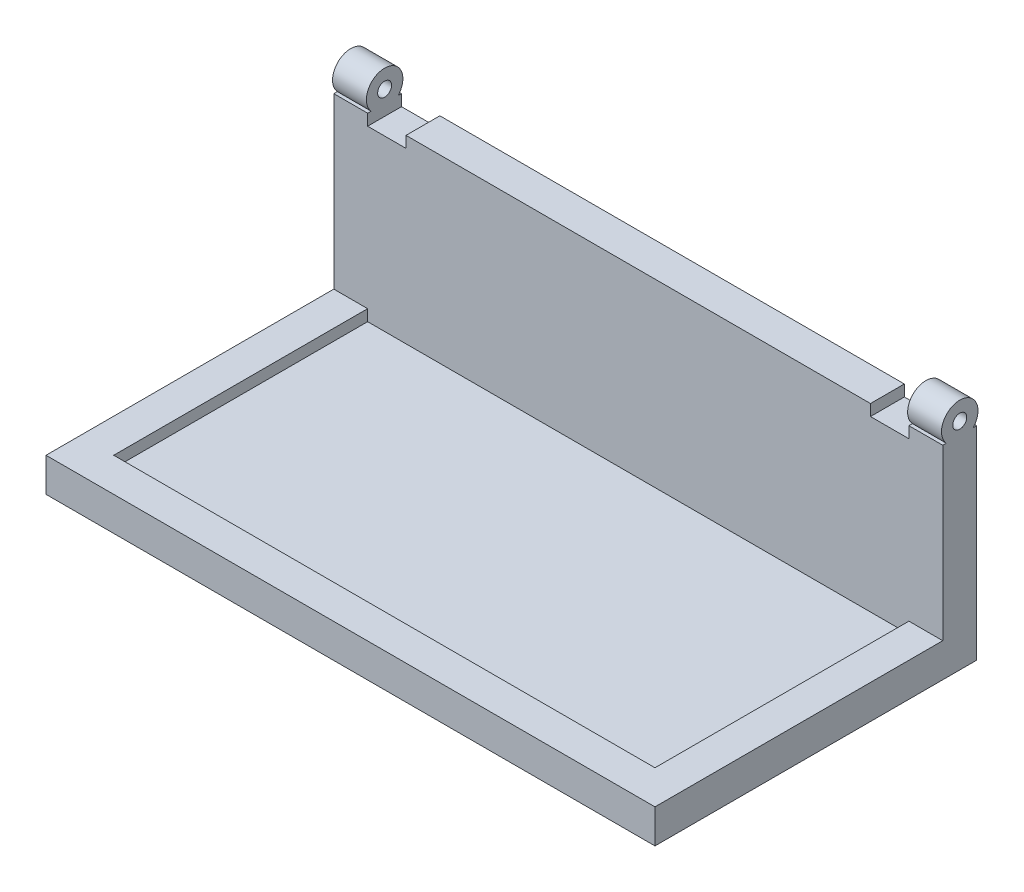
ISO-10303-21;
HEADER;
FILE_DESCRIPTION(('STEP AP214'),'2;1');
FILE_NAME('part.step','',(''),(''),'','','');
FILE_SCHEMA(('AUTOMOTIVE_DESIGN { 1 0 10303 214 1 1 1 1 }'));
ENDSEC;
DATA;
#1=APPLICATION_CONTEXT('core data for automotive mechanical design processes');
#2=APPLICATION_PROTOCOL_DEFINITION('international standard','automotive_design',2000,#1);
#3=PRODUCT_CONTEXT('',#1,'mechanical');
#4=PRODUCT('Part','Part','',(#3));
#5=PRODUCT_RELATED_PRODUCT_CATEGORY('part','',(#4));
#6=PRODUCT_DEFINITION_FORMATION('','',#4);
#7=PRODUCT_DEFINITION_CONTEXT('part definition',#1,'design');
#8=PRODUCT_DEFINITION('design','',#6,#7);
#9=PRODUCT_DEFINITION_SHAPE('','',#8);
#10=(LENGTH_UNIT() NAMED_UNIT(*) SI_UNIT(.MILLI.,.METRE.));
#11=(NAMED_UNIT(*) PLANE_ANGLE_UNIT() SI_UNIT($,.RADIAN.));
#12=(NAMED_UNIT(*) SI_UNIT($,.STERADIAN.) SOLID_ANGLE_UNIT());
#13=UNCERTAINTY_MEASURE_WITH_UNIT(LENGTH_MEASURE(1.E-05),#10,'distance_accuracy_value','');
#14=(GEOMETRIC_REPRESENTATION_CONTEXT(3) GLOBAL_UNCERTAINTY_ASSIGNED_CONTEXT((#13)) GLOBAL_UNIT_ASSIGNED_CONTEXT((#10,
#11,#12)) REPRESENTATION_CONTEXT('',''));
#15=CARTESIAN_POINT('',(0.,0.,0.));
#16=DIRECTION('',(0.,0.,1.));
#17=DIRECTION('',(1.,0.,0.));
#18=AXIS2_PLACEMENT_3D('',#15,#16,#17);
#19=CARTESIAN_POINT('',(0.,90.,0.));
#20=DIRECTION('',(0.,1.,0.));
#21=DIRECTION('',(0.,0.,1.));
#22=AXIS2_PLACEMENT_3D('',#19,#20,#21);
#23=PLANE('',#22);
#24=DIRECTION('',(0.,0.,1.));
#25=VECTOR('',#24,1.);
#26=CARTESIAN_POINT('',(-143.208401976936,90.,0.));
#27=LINE('',#26,#25);
#28=CARTESIAN_POINT('',(-143.208401976936,90.,-83.5425041186162));
#29=VERTEX_POINT('',#28);
#30=CARTESIAN_POINT('',(-143.208401976936,90.,-82.0449720805085));
#31=VERTEX_POINT('',#30);
#32=EDGE_CURVE('E201',#29,#31,#27,.T.);
#33=ORIENTED_EDGE('',*,*,#32,.F.);
#34=DIRECTION('',(-1.,0.,0.));
#35=VECTOR('',#34,1.);
#36=CARTESIAN_POINT('',(111.591598023064,90.,-83.5425041186161));
#37=LINE('',#36,#35);
#38=CARTESIAN_POINT('',(-158.208401976936,90.,-83.5425041186162));
#39=VERTEX_POINT('',#38);
#40=EDGE_CURVE('E272',#29,#39,#37,.T.);
#41=ORIENTED_EDGE('',*,*,#40,.T.);
#42=DIRECTION('',(0.,0.,1.));
#43=VECTOR('',#42,1.);
#44=CARTESIAN_POINT('',(-158.208401976936,90.,-83.5425041186162));
#45=LINE('',#44,#43);
#46=CARTESIAN_POINT('',(-158.208401976936,90.,-82.0449720805085));
#47=VERTEX_POINT('',#46);
#48=EDGE_CURVE('E278',#39,#47,#45,.T.);
#49=ORIENTED_EDGE('',*,*,#48,.T.);
#50=DIRECTION('',(1.,0.,0.));
#51=VECTOR('',#50,1.);
#52=CARTESIAN_POINT('',(-158.208401976936,90.,-82.0449720805085));
#53=LINE('',#52,#51);
#54=EDGE_CURVE('E347',#31,#47,#53,.F.);
#55=ORIENTED_EDGE('',*,*,#54,.F.);
#56=EDGE_LOOP('',(#33,#41,#49,#55));
#57=FACE_BOUND('',#56,.T.);
#58=ADVANCED_FACE('F34',(#57),#23,.T.);
#59=CARTESIAN_POINT('',(-143.208401976936,90.,-70.0970029147323));
#60=VERTEX_POINT('',#59);
#61=CARTESIAN_POINT('',(-143.208401976936,90.,-68.5425041186162));
#62=VERTEX_POINT('',#61);
#63=EDGE_CURVE('E384',#60,#62,#27,.T.);
#64=ORIENTED_EDGE('',*,*,#63,.F.);
#65=DIRECTION('',(1.,0.,0.));
#66=VECTOR('',#65,1.);
#67=CARTESIAN_POINT('',(-158.208401976936,90.,-70.0970029147323));
#68=LINE('',#67,#66);
#69=CARTESIAN_POINT('',(-158.208401976936,90.,-70.0970029147323));
#70=VERTEX_POINT('',#69);
#71=EDGE_CURVE('E350',#70,#60,#68,.T.);
#72=ORIENTED_EDGE('',*,*,#71,.F.);
#73=CARTESIAN_POINT('',(-158.208401976936,90.,-68.5425041186162));
#74=VERTEX_POINT('',#73);
#75=EDGE_CURVE('E276',#70,#74,#45,.T.);
#76=ORIENTED_EDGE('',*,*,#75,.T.);
#77=DIRECTION('',(1.,0.,0.));
#78=VECTOR('',#77,1.);
#79=CARTESIAN_POINT('',(-143.208401976936,90.,-68.5425041186162));
#80=LINE('',#79,#78);
#81=EDGE_CURVE('E266',#74,#62,#80,.T.);
#82=ORIENTED_EDGE('',*,*,#81,.T.);
#83=EDGE_LOOP('',(#64,#72,#76,#82));
#84=FACE_BOUND('',#83,.T.);
#85=ADVANCED_FACE('F409',(#84),#23,.T.);
#86=DIRECTION('',(0.,0.,-1.));
#87=VECTOR('',#86,1.);
#88=CARTESIAN_POINT('',(-126.208401976936,90.,0.));
#89=LINE('',#88,#87);
#90=CARTESIAN_POINT('',(-126.208401976936,90.,-68.5425041186162));
#91=VERTEX_POINT('',#90);
#92=CARTESIAN_POINT('',(-126.208401976936,90.,-83.5425041186161));
#93=VERTEX_POINT('',#92);
#94=EDGE_CURVE('E230',#91,#93,#89,.T.);
#95=ORIENTED_EDGE('',*,*,#94,.F.);
#96=CARTESIAN_POINT('',(79.5688678934987,90.,-68.5425041186162));
#97=VERTEX_POINT('',#96);
#98=EDGE_CURVE('E207',#91,#97,#80,.T.);
#99=ORIENTED_EDGE('',*,*,#98,.T.);
#100=DIRECTION('',(0.,0.,1.));
#101=VECTOR('',#100,1.);
#102=CARTESIAN_POINT('',(79.5688678934987,90.,-83.5425041186161));
#103=LINE('',#102,#101);
#104=CARTESIAN_POINT('',(79.5688678934987,90.,-83.5425041186161));
#105=VERTEX_POINT('',#104);
#106=EDGE_CURVE('E224',#105,#97,#103,.T.);
#107=ORIENTED_EDGE('',*,*,#106,.F.);
#108=EDGE_CURVE('E277',#105,#93,#37,.T.);
#109=ORIENTED_EDGE('',*,*,#108,.T.);
#110=EDGE_LOOP('',(#95,#99,#107,#109));
#111=FACE_BOUND('',#110,.T.);
#112=ADVANCED_FACE('F381',(#111),#23,.T.);
#113=DIRECTION('',(0.,0.,-1.));
#114=VECTOR('',#113,1.);
#115=CARTESIAN_POINT('',(96.5915980230643,90.,-68.5425041186161));
#116=LINE('',#115,#114);
#117=CARTESIAN_POINT('',(96.5915980230643,90.,-68.5425041186161));
#118=VERTEX_POINT('',#117);
#119=CARTESIAN_POINT('',(96.5915980230643,90.,-70.0970029147323));
#120=VERTEX_POINT('',#119);
#121=EDGE_CURVE('E228',#118,#120,#116,.T.);
#122=ORIENTED_EDGE('',*,*,#121,.F.);
#123=CARTESIAN_POINT('',(111.591598023064,90.,-68.5425041186162));
#124=VERTEX_POINT('',#123);
#125=EDGE_CURVE('E270',#118,#124,#80,.T.);
#126=ORIENTED_EDGE('',*,*,#125,.T.);
#127=DIRECTION('',(0.,0.,-1.));
#128=VECTOR('',#127,1.);
#129=CARTESIAN_POINT('',(111.591598023064,90.,-68.5425041186162));
#130=LINE('',#129,#128);
#131=CARTESIAN_POINT('',(111.591598023064,90.,-70.0970029147323));
#132=VERTEX_POINT('',#131);
#133=EDGE_CURVE('E55',#124,#132,#130,.T.);
#134=ORIENTED_EDGE('',*,*,#133,.T.);
#135=DIRECTION('',(-1.,0.,0.));
#136=VECTOR('',#135,1.);
#137=CARTESIAN_POINT('',(111.591598023064,90.,-70.0970029147323));
#138=LINE('',#137,#136);
#139=EDGE_CURVE('E42',#120,#132,#138,.F.);
#140=ORIENTED_EDGE('',*,*,#139,.F.);
#141=EDGE_LOOP('',(#122,#126,#134,#140));
#142=FACE_BOUND('',#141,.T.);
#143=ADVANCED_FACE('F378',(#142),#23,.T.);
#144=CARTESIAN_POINT('',(-158.208401976936,15.,58.9574958813839));
#145=DIRECTION('',(0.,0.,-1.));
#146=DIRECTION('',(-1.,0.,0.));
#147=AXIS2_PLACEMENT_3D('',#144,#145,#146);
#148=PLANE('',#147);
#149=DIRECTION('',(1.,0.,0.));
#150=VECTOR('',#149,1.);
#151=CARTESIAN_POINT('',(-158.208401976936,0.,58.9574958813839));
#152=LINE('',#151,#150);
#153=CARTESIAN_POINT('',(-158.208401976936,0.,58.9574958813839));
#154=VERTEX_POINT('',#153);
#155=CARTESIAN_POINT('',(111.591598023064,0.,58.9574958813839));
#156=VERTEX_POINT('',#155);
#157=EDGE_CURVE('E312',#154,#156,#152,.T.);
#158=ORIENTED_EDGE('',*,*,#157,.T.);
#159=DIRECTION('',(0.,-1.,0.));
#160=VECTOR('',#159,1.);
#161=CARTESIAN_POINT('',(111.591598023064,15.,58.9574958813839));
#162=LINE('',#161,#160);
#163=CARTESIAN_POINT('',(111.591598023064,15.,58.9574958813839));
#164=VERTEX_POINT('',#163);
#165=EDGE_CURVE('E344',#164,#156,#162,.T.);
#166=ORIENTED_EDGE('',*,*,#165,.F.);
#167=DIRECTION('',(1.,0.,0.));
#168=VECTOR('',#167,1.);
#169=CARTESIAN_POINT('',(-158.208401976936,15.,58.9574958813839));
#170=LINE('',#169,#168);
#171=CARTESIAN_POINT('',(-158.208401976936,15.,58.9574958813839));
#172=VERTEX_POINT('',#171);
#173=EDGE_CURVE('E320',#172,#164,#170,.T.);
#174=ORIENTED_EDGE('',*,*,#173,.F.);
#175=DIRECTION('',(0.,-1.,0.));
#176=VECTOR('',#175,1.);
#177=CARTESIAN_POINT('',(-158.208401976936,15.,58.9574958813839));
#178=LINE('',#177,#176);
#179=EDGE_CURVE('E328',#172,#154,#178,.T.);
#180=ORIENTED_EDGE('',*,*,#179,.T.);
#181=EDGE_LOOP('',(#158,#166,#174,#180));
#182=FACE_BOUND('',#181,.T.);
#183=ADVANCED_FACE('F36',(#182),#148,.F.);
#184=CARTESIAN_POINT('',(111.591598023064,15.,58.9574958813839));
#185=DIRECTION('',(-1.,0.,0.));
#186=DIRECTION('',(0.,0.,1.));
#187=AXIS2_PLACEMENT_3D('',#184,#185,#186);
#188=PLANE('',#187);
#189=CARTESIAN_POINT('',(111.591598023064,90.,-82.0449720805085));
#190=VERTEX_POINT('',#189);
#191=CARTESIAN_POINT('',(111.591598023064,90.,-83.5425041186161));
#192=VERTEX_POINT('',#191);
#193=EDGE_CURVE('E269',#190,#192,#130,.T.);
#194=ORIENTED_EDGE('',*,*,#193,.F.);
#195=CARTESIAN_POINT('',(111.591598023064,95.4538367899318,-76.0709874976204));
#196=DIRECTION('',(-1.,0.,0.));
#197=DIRECTION('',(0.,0.,1.));
#198=AXIS2_PLACEMENT_3D('',#195,#196,#197);
#199=CIRCLE('',#198,8.08905603440837);
#200=EDGE_CURVE('E248',#132,#190,#199,.T.);
#201=ORIENTED_EDGE('',*,*,#200,.F.);
#202=ORIENTED_EDGE('',*,*,#133,.F.);
#203=DIRECTION('',(0.,-1.,0.));
#204=VECTOR('',#203,1.);
#205=CARTESIAN_POINT('',(111.591598023064,90.,-68.5425041186162));
#206=LINE('',#205,#204);
#207=CARTESIAN_POINT('',(111.591598023064,15.,-68.5425041186162));
#208=VERTEX_POINT('',#207);
#209=EDGE_CURVE('E286',#124,#208,#206,.T.);
#210=ORIENTED_EDGE('',*,*,#209,.T.);
#211=DIRECTION('',(0.,0.,-1.));
#212=VECTOR('',#211,1.);
#213=CARTESIAN_POINT('',(111.591598023064,15.,58.9574958813839));
#214=LINE('',#213,#212);
#215=EDGE_CURVE('E323',#164,#208,#214,.T.);
#216=ORIENTED_EDGE('',*,*,#215,.F.);
#217=ORIENTED_EDGE('',*,*,#165,.T.);
#218=DIRECTION('',(0.,0.,-1.));
#219=VECTOR('',#218,1.);
#220=CARTESIAN_POINT('',(111.591598023064,0.,58.9574958813839));
#221=LINE('',#220,#219);
#222=CARTESIAN_POINT('',(111.591598023064,0.,-83.5425041186161));
#223=VERTEX_POINT('',#222);
#224=EDGE_CURVE('E331',#156,#223,#221,.T.);
#225=ORIENTED_EDGE('',*,*,#224,.T.);
#226=DIRECTION('',(0.,-1.,0.));
#227=VECTOR('',#226,1.);
#228=CARTESIAN_POINT('',(111.591598023064,15.,-83.5425041186161));
#229=LINE('',#228,#227);
#230=EDGE_CURVE('E341',#192,#223,#229,.T.);
#231=ORIENTED_EDGE('',*,*,#230,.F.);
#232=EDGE_LOOP('',(#194,#201,#202,#210,#216,#217,#225,#231));
#233=FACE_BOUND('',#232,.T.);
#234=CARTESIAN_POINT('',(111.591598023064,95.4538367899318,-76.0709874976204));
#235=DIRECTION('',(-1.,0.,0.));
#236=DIRECTION('',(0.,0.,1.));
#237=AXIS2_PLACEMENT_3D('',#234,#235,#236);
#238=CIRCLE('',#237,3.08905603440837);
#239=CARTESIAN_POINT('',(111.591598023064,95.4538367899318,-72.981931463212));
#240=VERTEX_POINT('',#239);
#241=EDGE_CURVE('E240',#240,#240,#238,.T.);
#242=ORIENTED_EDGE('',*,*,#241,.T.);
#243=EDGE_LOOP('',(#242));
#244=FACE_BOUND('',#243,.T.);
#245=ADVANCED_FACE('F358',(#233,#244),#188,.F.);
#246=CARTESIAN_POINT('',(-158.208401976936,15.,-83.5425041186162));
#247=DIRECTION('',(0.,0.,1.));
#248=DIRECTION('',(1.,0.,0.));
#249=AXIS2_PLACEMENT_3D('',#246,#247,#248);
#250=PLANE('',#249);
#251=ORIENTED_EDGE('',*,*,#40,.F.);
#252=DIRECTION('',(0.,1.,0.));
#253=VECTOR('',#252,1.);
#254=CARTESIAN_POINT('',(-143.208401976936,85.,-83.5425041186162));
#255=LINE('',#254,#253);
#256=CARTESIAN_POINT('',(-143.208401976936,85.,-83.5425041186162));
#257=VERTEX_POINT('',#256);
#258=EDGE_CURVE('E209',#257,#29,#255,.T.);
#259=ORIENTED_EDGE('',*,*,#258,.F.);
#260=DIRECTION('',(-1.,0.,0.));
#261=VECTOR('',#260,1.);
#262=CARTESIAN_POINT('',(0.,85.,-83.5425041186161));
#263=LINE('',#262,#261);
#264=CARTESIAN_POINT('',(-126.208401976936,85.,-83.5425041186161));
#265=VERTEX_POINT('',#264);
#266=EDGE_CURVE('E191',#265,#257,#263,.T.);
#267=ORIENTED_EDGE('',*,*,#266,.F.);
#268=DIRECTION('',(0.,1.,0.));
#269=VECTOR('',#268,1.);
#270=CARTESIAN_POINT('',(-126.208401976936,85.,-83.5425041186161));
#271=LINE('',#270,#269);
#272=EDGE_CURVE('E188',#265,#93,#271,.T.);
#273=ORIENTED_EDGE('',*,*,#272,.T.);
#274=ORIENTED_EDGE('',*,*,#108,.F.);
#275=DIRECTION('',(0.,1.,0.));
#276=VECTOR('',#275,1.);
#277=CARTESIAN_POINT('',(79.5688678934987,85.,-83.5425041186161));
#278=LINE('',#277,#276);
#279=CARTESIAN_POINT('',(79.5688678934987,85.,-83.5425041186161));
#280=VERTEX_POINT('',#279);
#281=EDGE_CURVE('E220',#280,#105,#278,.T.);
#282=ORIENTED_EDGE('',*,*,#281,.F.);
#283=DIRECTION('',(-1.,0.,0.));
#284=VECTOR('',#283,1.);
#285=CARTESIAN_POINT('',(96.5915980230643,85.,-83.5425041186161));
#286=LINE('',#285,#284);
#287=CARTESIAN_POINT('',(96.5915980230643,85.,-83.5425041186161));
#288=VERTEX_POINT('',#287);
#289=EDGE_CURVE('E233',#288,#280,#286,.T.);
#290=ORIENTED_EDGE('',*,*,#289,.F.);
#291=DIRECTION('',(0.,1.,0.));
#292=VECTOR('',#291,1.);
#293=CARTESIAN_POINT('',(96.5915980230643,85.,-83.5425041186161));
#294=LINE('',#293,#292);
#295=CARTESIAN_POINT('',(96.5915980230643,90.,-83.5425041186161));
#296=VERTEX_POINT('',#295);
#297=EDGE_CURVE('E217',#288,#296,#294,.T.);
#298=ORIENTED_EDGE('',*,*,#297,.T.);
#299=EDGE_CURVE('E273',#192,#296,#37,.T.);
#300=ORIENTED_EDGE('',*,*,#299,.F.);
#301=ORIENTED_EDGE('',*,*,#230,.T.);
#302=DIRECTION('',(-1.,0.,0.));
#303=VECTOR('',#302,1.);
#304=CARTESIAN_POINT('',(-158.208401976936,0.,-83.5425041186162));
#305=LINE('',#304,#303);
#306=CARTESIAN_POINT('',(-158.208401976936,0.,-83.5425041186162));
#307=VERTEX_POINT('',#306);
#308=EDGE_CURVE('E333',#223,#307,#305,.T.);
#309=ORIENTED_EDGE('',*,*,#308,.T.);
#310=DIRECTION('',(0.,-1.,0.));
#311=VECTOR('',#310,1.);
#312=CARTESIAN_POINT('',(-158.208401976936,15.,-83.5425041186162));
#313=LINE('',#312,#311);
#314=EDGE_CURVE('E338',#39,#307,#313,.T.);
#315=ORIENTED_EDGE('',*,*,#314,.F.);
#316=EDGE_LOOP('',(#251,#259,#267,#273,#274,#282,#290,#298,#300,#301,#309,#315));
#317=FACE_BOUND('',#316,.T.);
#318=ADVANCED_FACE('F366',(#317),#250,.F.);
#319=CARTESIAN_POINT('',(-158.208401976936,15.,58.9574958813839));
#320=DIRECTION('',(1.,0.,0.));
#321=DIRECTION('',(0.,0.,-1.));
#322=AXIS2_PLACEMENT_3D('',#319,#320,#321);
#323=PLANE('',#322);
#324=ORIENTED_EDGE('',*,*,#75,.F.);
#325=CARTESIAN_POINT('',(-158.208401976936,95.4538367899318,-76.0709874976204));
#326=DIRECTION('',(1.,0.,0.));
#327=DIRECTION('',(0.,0.,-1.));
#328=AXIS2_PLACEMENT_3D('',#325,#326,#327);
#329=CIRCLE('',#328,8.08905603440837);
#330=EDGE_CURVE('E260',#47,#70,#329,.T.);
#331=ORIENTED_EDGE('',*,*,#330,.F.);
#332=ORIENTED_EDGE('',*,*,#48,.F.);
#333=ORIENTED_EDGE('',*,*,#314,.T.);
#334=DIRECTION('',(0.,0.,1.));
#335=VECTOR('',#334,1.);
#336=CARTESIAN_POINT('',(-158.208401976936,0.,58.9574958813839));
#337=LINE('',#336,#335);
#338=EDGE_CURVE('E324',#307,#154,#337,.T.);
#339=ORIENTED_EDGE('',*,*,#338,.T.);
#340=ORIENTED_EDGE('',*,*,#179,.F.);
#341=DIRECTION('',(0.,0.,1.));
#342=VECTOR('',#341,1.);
#343=CARTESIAN_POINT('',(-158.208401976936,15.,58.9574958813839));
#344=LINE('',#343,#342);
#345=CARTESIAN_POINT('',(-158.208401976936,15.,-68.5425041186162));
#346=VERTEX_POINT('',#345);
#347=EDGE_CURVE('E326',#346,#172,#344,.T.);
#348=ORIENTED_EDGE('',*,*,#347,.F.);
#349=DIRECTION('',(0.,-1.,0.));
#350=VECTOR('',#349,1.);
#351=CARTESIAN_POINT('',(-158.208401976936,90.,-68.5425041186162));
#352=LINE('',#351,#350);
#353=EDGE_CURVE('E280',#74,#346,#352,.T.);
#354=ORIENTED_EDGE('',*,*,#353,.F.);
#355=EDGE_LOOP('',(#324,#331,#332,#333,#339,#340,#348,#354));
#356=FACE_BOUND('',#355,.T.);
#357=CARTESIAN_POINT('',(-158.208401976936,95.4538367899318,-76.0709874976204));
#358=DIRECTION('',(1.,0.,0.));
#359=DIRECTION('',(0.,0.,-1.));
#360=AXIS2_PLACEMENT_3D('',#357,#358,#359);
#361=CIRCLE('',#360,3.08905603440837);
#362=CARTESIAN_POINT('',(-158.208401976936,95.4538367899318,-79.1600435320288));
#363=VERTEX_POINT('',#362);
#364=EDGE_CURVE('E254',#363,#363,#361,.T.);
#365=ORIENTED_EDGE('',*,*,#364,.T.);
#366=EDGE_LOOP('',(#365));
#367=FACE_BOUND('',#366,.T.);
#368=ADVANCED_FACE('F402',(#356,#367),#323,.F.);
#369=CARTESIAN_POINT('',(0.,15.,0.));
#370=DIRECTION('',(0.,1.,0.));
#371=DIRECTION('',(0.,0.,1.));
#372=AXIS2_PLACEMENT_3D('',#369,#370,#371);
#373=PLANE('',#372);
#374=DIRECTION('',(1.,0.,0.));
#375=VECTOR('',#374,1.);
#376=CARTESIAN_POINT('',(-143.208401976936,15.,-68.5425041186162));
#377=LINE('',#376,#375);
#378=CARTESIAN_POINT('',(-143.208401976936,15.,-68.5425041186162));
#379=VERTEX_POINT('',#378);
#380=EDGE_CURVE('E263',#346,#379,#377,.T.);
#381=ORIENTED_EDGE('',*,*,#380,.F.);
#382=ORIENTED_EDGE('',*,*,#347,.T.);
#383=ORIENTED_EDGE('',*,*,#173,.T.);
#384=ORIENTED_EDGE('',*,*,#215,.T.);
#385=CARTESIAN_POINT('',(96.5915980230643,15.,-68.5425041186161));
#386=VERTEX_POINT('',#385);
#387=EDGE_CURVE('E283',#386,#208,#377,.T.);
#388=ORIENTED_EDGE('',*,*,#387,.F.);
#389=DIRECTION('',(0.,0.,-1.));
#390=VECTOR('',#389,1.);
#391=CARTESIAN_POINT('',(96.5915980230643,15.,43.9574958813839));
#392=LINE('',#391,#390);
#393=CARTESIAN_POINT('',(96.5915980230643,15.,43.9574958813839));
#394=VERTEX_POINT('',#393);
#395=EDGE_CURVE('E294',#394,#386,#392,.T.);
#396=ORIENTED_EDGE('',*,*,#395,.F.);
#397=DIRECTION('',(1.,0.,0.));
#398=VECTOR('',#397,1.);
#399=CARTESIAN_POINT('',(-143.208401976936,15.,43.9574958813839));
#400=LINE('',#399,#398);
#401=CARTESIAN_POINT('',(-143.208401976936,15.,43.9574958813839));
#402=VERTEX_POINT('',#401);
#403=EDGE_CURVE('E305',#402,#394,#400,.T.);
#404=ORIENTED_EDGE('',*,*,#403,.F.);
#405=DIRECTION('',(0.,0.,1.));
#406=VECTOR('',#405,1.);
#407=CARTESIAN_POINT('',(-143.208401976936,15.,-68.5425041186162));
#408=LINE('',#407,#406);
#409=EDGE_CURVE('E289',#379,#402,#408,.T.);
#410=ORIENTED_EDGE('',*,*,#409,.F.);
#411=EDGE_LOOP('',(#381,#382,#383,#384,#388,#396,#404,#410));
#412=FACE_BOUND('',#411,.T.);
#413=ADVANCED_FACE('F416',(#412),#373,.T.);
#414=CARTESIAN_POINT('',(0.,0.,0.));
#415=DIRECTION('',(0.,1.,0.));
#416=DIRECTION('',(0.,0.,1.));
#417=AXIS2_PLACEMENT_3D('',#414,#415,#416);
#418=PLANE('',#417);
#419=ORIENTED_EDGE('',*,*,#157,.F.);
#420=ORIENTED_EDGE('',*,*,#338,.F.);
#421=ORIENTED_EDGE('',*,*,#308,.F.);
#422=ORIENTED_EDGE('',*,*,#224,.F.);
#423=EDGE_LOOP('',(#419,#420,#421,#422));
#424=FACE_BOUND('',#423,.T.);
#425=ADVANCED_FACE('F435',(#424),#418,.F.);
#426=CARTESIAN_POINT('',(-143.208401976936,10.,-68.5425041186162));
#427=DIRECTION('',(-1.,0.,0.));
#428=DIRECTION('',(0.,0.,1.));
#429=AXIS2_PLACEMENT_3D('',#426,#427,#428);
#430=PLANE('',#429);
#431=ORIENTED_EDGE('',*,*,#409,.T.);
#432=DIRECTION('',(0.,1.,0.));
#433=VECTOR('',#432,1.);
#434=CARTESIAN_POINT('',(-143.208401976936,10.,43.9574958813839));
#435=LINE('',#434,#433);
#436=CARTESIAN_POINT('',(-143.208401976936,10.,43.9574958813839));
#437=VERTEX_POINT('',#436);
#438=EDGE_CURVE('E303',#437,#402,#435,.T.);
#439=ORIENTED_EDGE('',*,*,#438,.F.);
#440=DIRECTION('',(0.,0.,1.));
#441=VECTOR('',#440,1.);
#442=CARTESIAN_POINT('',(-143.208401976936,10.,-68.5425041186162));
#443=LINE('',#442,#441);
#444=CARTESIAN_POINT('',(-143.208401976936,10.,-68.5425041186162));
#445=VERTEX_POINT('',#444);
#446=EDGE_CURVE('E290',#445,#437,#443,.T.);
#447=ORIENTED_EDGE('',*,*,#446,.F.);
#448=DIRECTION('',(0.,1.,0.));
#449=VECTOR('',#448,1.);
#450=CARTESIAN_POINT('',(-143.208401976936,10.,-68.5425041186162));
#451=LINE('',#450,#449);
#452=EDGE_CURVE('E310',#445,#379,#451,.T.);
#453=ORIENTED_EDGE('',*,*,#452,.T.);
#454=EDGE_LOOP('',(#431,#439,#447,#453));
#455=FACE_BOUND('',#454,.T.);
#456=ADVANCED_FACE('F420',(#455),#430,.F.);
#457=CARTESIAN_POINT('',(96.5915980230643,10.,-68.5425041186161));
#458=DIRECTION('',(0.,0.,-1.));
#459=DIRECTION('',(-1.,0.,0.));
#460=AXIS2_PLACEMENT_3D('',#457,#458,#459);
#461=PLANE('',#460);
#462=DIRECTION('',(1.,0.,0.));
#463=VECTOR('',#462,1.);
#464=CARTESIAN_POINT('',(0.,85.,-68.5425041186162));
#465=LINE('',#464,#463);
#466=CARTESIAN_POINT('',(-143.208401976936,85.,-68.5425041186162));
#467=VERTEX_POINT('',#466);
#468=CARTESIAN_POINT('',(-126.208401976936,85.,-68.5425041186162));
#469=VERTEX_POINT('',#468);
#470=EDGE_CURVE('E192',#467,#469,#465,.T.);
#471=ORIENTED_EDGE('',*,*,#470,.F.);
#472=DIRECTION('',(0.,1.,0.));
#473=VECTOR('',#472,1.);
#474=CARTESIAN_POINT('',(-143.208401976936,85.,-68.5425041186162));
#475=LINE('',#474,#473);
#476=EDGE_CURVE('E247',#467,#62,#475,.T.);
#477=ORIENTED_EDGE('',*,*,#476,.T.);
#478=ORIENTED_EDGE('',*,*,#81,.F.);
#479=ORIENTED_EDGE('',*,*,#353,.T.);
#480=ORIENTED_EDGE('',*,*,#380,.T.);
#481=ORIENTED_EDGE('',*,*,#452,.F.);
#482=DIRECTION('',(-1.,0.,0.));
#483=VECTOR('',#482,1.);
#484=CARTESIAN_POINT('',(96.5915980230643,10.,-68.5425041186161));
#485=LINE('',#484,#483);
#486=CARTESIAN_POINT('',(96.5915980230643,10.,-68.5425041186161));
#487=VERTEX_POINT('',#486);
#488=EDGE_CURVE('E300',#487,#445,#485,.T.);
#489=ORIENTED_EDGE('',*,*,#488,.F.);
#490=DIRECTION('',(0.,1.,0.));
#491=VECTOR('',#490,1.);
#492=CARTESIAN_POINT('',(96.5915980230643,10.,-68.5425041186161));
#493=LINE('',#492,#491);
#494=EDGE_CURVE('E313',#487,#386,#493,.T.);
#495=ORIENTED_EDGE('',*,*,#494,.T.);
#496=ORIENTED_EDGE('',*,*,#387,.T.);
#497=ORIENTED_EDGE('',*,*,#209,.F.);
#498=ORIENTED_EDGE('',*,*,#125,.F.);
#499=DIRECTION('',(0.,1.,0.));
#500=VECTOR('',#499,1.);
#501=CARTESIAN_POINT('',(96.5915980230643,85.,-68.5425041186161));
#502=LINE('',#501,#500);
#503=CARTESIAN_POINT('',(96.5915980230643,85.,-68.5425041186161));
#504=VERTEX_POINT('',#503);
#505=EDGE_CURVE('E214',#504,#118,#502,.T.);
#506=ORIENTED_EDGE('',*,*,#505,.F.);
#507=DIRECTION('',(1.,0.,0.));
#508=VECTOR('',#507,1.);
#509=CARTESIAN_POINT('',(79.5688678934987,85.,-68.5425041186162));
#510=LINE('',#509,#508);
#511=CARTESIAN_POINT('',(79.5688678934987,85.,-68.5425041186162));
#512=VERTEX_POINT('',#511);
#513=EDGE_CURVE('E227',#512,#504,#510,.T.);
#514=ORIENTED_EDGE('',*,*,#513,.F.);
#515=DIRECTION('',(0.,1.,0.));
#516=VECTOR('',#515,1.);
#517=CARTESIAN_POINT('',(79.5688678934987,85.,-68.5425041186162));
#518=LINE('',#517,#516);
#519=EDGE_CURVE('E222',#512,#97,#518,.T.);
#520=ORIENTED_EDGE('',*,*,#519,.T.);
#521=ORIENTED_EDGE('',*,*,#98,.F.);
#522=DIRECTION('',(0.,1.,0.));
#523=VECTOR('',#522,1.);
#524=CARTESIAN_POINT('',(-126.208401976936,85.,-68.5425041186162));
#525=LINE('',#524,#523);
#526=EDGE_CURVE('E185',#469,#91,#525,.T.);
#527=ORIENTED_EDGE('',*,*,#526,.F.);
#528=EDGE_LOOP('',(#471,#477,#478,#479,#480,#481,#489,#495,#496,#497,#498,#506,#514,#520,#521,#527));
#529=FACE_BOUND('',#528,.T.);
#530=ADVANCED_FACE('F204',(#529),#461,.F.);
#531=CARTESIAN_POINT('',(96.5915980230643,10.,43.9574958813839));
#532=DIRECTION('',(1.,0.,0.));
#533=DIRECTION('',(0.,0.,-1.));
#534=AXIS2_PLACEMENT_3D('',#531,#532,#533);
#535=PLANE('',#534);
#536=ORIENTED_EDGE('',*,*,#395,.T.);
#537=ORIENTED_EDGE('',*,*,#494,.F.);
#538=DIRECTION('',(0.,0.,-1.));
#539=VECTOR('',#538,1.);
#540=CARTESIAN_POINT('',(96.5915980230643,10.,43.9574958813839));
#541=LINE('',#540,#539);
#542=CARTESIAN_POINT('',(96.5915980230643,10.,43.9574958813839));
#543=VERTEX_POINT('',#542);
#544=EDGE_CURVE('E297',#543,#487,#541,.T.);
#545=ORIENTED_EDGE('',*,*,#544,.F.);
#546=DIRECTION('',(0.,1.,0.));
#547=VECTOR('',#546,1.);
#548=CARTESIAN_POINT('',(96.5915980230643,10.,43.9574958813839));
#549=LINE('',#548,#547);
#550=EDGE_CURVE('E316',#543,#394,#549,.T.);
#551=ORIENTED_EDGE('',*,*,#550,.T.);
#552=EDGE_LOOP('',(#536,#537,#545,#551));
#553=FACE_BOUND('',#552,.T.);
#554=ADVANCED_FACE('F429',(#553),#535,.F.);
#555=CARTESIAN_POINT('',(-143.208401976936,10.,43.9574958813839));
#556=DIRECTION('',(0.,0.,1.));
#557=DIRECTION('',(1.,0.,0.));
#558=AXIS2_PLACEMENT_3D('',#555,#556,#557);
#559=PLANE('',#558);
#560=ORIENTED_EDGE('',*,*,#403,.T.);
#561=ORIENTED_EDGE('',*,*,#550,.F.);
#562=DIRECTION('',(1.,0.,0.));
#563=VECTOR('',#562,1.);
#564=CARTESIAN_POINT('',(-143.208401976936,10.,43.9574958813839));
#565=LINE('',#564,#563);
#566=EDGE_CURVE('E293',#437,#543,#565,.T.);
#567=ORIENTED_EDGE('',*,*,#566,.F.);
#568=ORIENTED_EDGE('',*,*,#438,.T.);
#569=EDGE_LOOP('',(#560,#561,#567,#568));
#570=FACE_BOUND('',#569,.T.);
#571=ADVANCED_FACE('F423',(#570),#559,.F.);
#572=CARTESIAN_POINT('',(0.,10.,0.));
#573=DIRECTION('',(0.,1.,0.));
#574=DIRECTION('',(0.,0.,1.));
#575=AXIS2_PLACEMENT_3D('',#572,#573,#574);
#576=PLANE('',#575);
#577=ORIENTED_EDGE('',*,*,#446,.T.);
#578=ORIENTED_EDGE('',*,*,#566,.T.);
#579=ORIENTED_EDGE('',*,*,#544,.T.);
#580=ORIENTED_EDGE('',*,*,#488,.T.);
#581=EDGE_LOOP('',(#577,#578,#579,#580));
#582=FACE_BOUND('',#581,.T.);
#583=ADVANCED_FACE('F426',(#582),#576,.T.);
#584=CARTESIAN_POINT('',(96.5915980230643,90.,-82.0449720805085));
#585=VERTEX_POINT('',#584);
#586=EDGE_CURVE('E226',#585,#296,#116,.T.);
#587=ORIENTED_EDGE('',*,*,#586,.F.);
#588=DIRECTION('',(-1.,0.,0.));
#589=VECTOR('',#588,1.);
#590=CARTESIAN_POINT('',(111.591598023064,90.,-82.0449720805085));
#591=LINE('',#590,#589);
#592=EDGE_CURVE('E11',#190,#585,#591,.T.);
#593=ORIENTED_EDGE('',*,*,#592,.F.);
#594=ORIENTED_EDGE('',*,*,#193,.T.);
#595=ORIENTED_EDGE('',*,*,#299,.T.);
#596=EDGE_LOOP('',(#587,#593,#594,#595));
#597=FACE_BOUND('',#596,.T.);
#598=ADVANCED_FACE('F363',(#597),#23,.T.);
#599=CARTESIAN_POINT('',(-158.208401976936,95.4538367899318,-76.0709874976204));
#600=DIRECTION('',(1.,0.,0.));
#601=DIRECTION('',(0.,0.,-1.));
#602=AXIS2_PLACEMENT_3D('',#599,#600,#601);
#603=CYLINDRICAL_SURFACE('',#602,8.08905603440837);
#604=ORIENTED_EDGE('',*,*,#330,.T.);
#605=ORIENTED_EDGE('',*,*,#71,.T.);
#606=CARTESIAN_POINT('',(-143.208401976936,95.4538367899318,-76.0709874976204));
#607=DIRECTION('',(1.,0.,0.));
#608=DIRECTION('',(0.,0.,-1.));
#609=AXIS2_PLACEMENT_3D('',#606,#607,#608);
#610=CIRCLE('',#609,8.08905603440837);
#611=EDGE_CURVE('E257',#31,#60,#610,.T.);
#612=ORIENTED_EDGE('',*,*,#611,.F.);
#613=ORIENTED_EDGE('',*,*,#54,.T.);
#614=EDGE_LOOP('',(#604,#605,#612,#613));
#615=FACE_BOUND('',#614,.T.);
#616=ADVANCED_FACE('F405',(#615),#603,.T.);
#617=CARTESIAN_POINT('',(-143.208401976936,95.4538367899318,-76.0709874976204));
#618=DIRECTION('',(1.,0.,0.));
#619=DIRECTION('',(0.,0.,-1.));
#620=AXIS2_PLACEMENT_3D('',#617,#618,#619);
#621=PLANE('',#620);
#622=CARTESIAN_POINT('',(-143.208401976936,95.4538367899318,-76.0709874976204));
#623=DIRECTION('',(1.,0.,0.));
#624=DIRECTION('',(0.,0.,-1.));
#625=AXIS2_PLACEMENT_3D('',#622,#623,#624);
#626=CIRCLE('',#625,3.08905603440837);
#627=CARTESIAN_POINT('',(-143.208401976936,95.4538367899318,-79.1600435320288));
#628=VERTEX_POINT('',#627);
#629=EDGE_CURVE('E251',#628,#628,#626,.T.);
#630=ORIENTED_EDGE('',*,*,#629,.F.);
#631=EDGE_LOOP('',(#630));
#632=FACE_BOUND('',#631,.T.);
#633=ORIENTED_EDGE('',*,*,#611,.T.);
#634=ORIENTED_EDGE('',*,*,#63,.T.);
#635=ORIENTED_EDGE('',*,*,#476,.F.);
#636=DIRECTION('',(0.,0.,1.));
#637=VECTOR('',#636,1.);
#638=CARTESIAN_POINT('',(-143.208401976936,85.,0.));
#639=LINE('',#638,#637);
#640=EDGE_CURVE('E198',#257,#467,#639,.T.);
#641=ORIENTED_EDGE('',*,*,#640,.F.);
#642=ORIENTED_EDGE('',*,*,#258,.T.);
#643=ORIENTED_EDGE('',*,*,#32,.T.);
#644=EDGE_LOOP('',(#633,#634,#635,#641,#642,#643));
#645=FACE_BOUND('',#644,.T.);
#646=ADVANCED_FACE('F392',(#632,#645),#621,.T.);
#647=CARTESIAN_POINT('',(-158.208401976936,95.4538367899318,-76.0709874976204));
#648=DIRECTION('',(1.,0.,0.));
#649=DIRECTION('',(0.,0.,-1.));
#650=AXIS2_PLACEMENT_3D('',#647,#648,#649);
#651=CYLINDRICAL_SURFACE('',#650,3.08905603440837);
#652=ORIENTED_EDGE('',*,*,#364,.F.);
#653=EDGE_LOOP('',(#652));
#654=FACE_BOUND('',#653,.T.);
#655=ORIENTED_EDGE('',*,*,#629,.T.);
#656=EDGE_LOOP('',(#655));
#657=FACE_BOUND('',#656,.T.);
#658=ADVANCED_FACE('F504',(#654,#657),#651,.F.);
#659=CARTESIAN_POINT('',(111.591598023064,95.4538367899318,-76.0709874976204));
#660=DIRECTION('',(-1.,0.,0.));
#661=DIRECTION('',(0.,0.,1.));
#662=AXIS2_PLACEMENT_3D('',#659,#660,#661);
#663=CYLINDRICAL_SURFACE('',#662,8.08905603440837);
#664=ORIENTED_EDGE('',*,*,#200,.T.);
#665=ORIENTED_EDGE('',*,*,#592,.T.);
#666=CARTESIAN_POINT('',(96.5915980230643,95.4538367899318,-76.0709874976204));
#667=DIRECTION('',(-1.,0.,0.));
#668=DIRECTION('',(0.,0.,1.));
#669=AXIS2_PLACEMENT_3D('',#666,#667,#668);
#670=CIRCLE('',#669,8.08905603440837);
#671=EDGE_CURVE('E243',#120,#585,#670,.T.);
#672=ORIENTED_EDGE('',*,*,#671,.F.);
#673=ORIENTED_EDGE('',*,*,#139,.T.);
#674=EDGE_LOOP('',(#664,#665,#672,#673));
#675=FACE_BOUND('',#674,.T.);
#676=ADVANCED_FACE('F355',(#675),#663,.T.);
#677=CARTESIAN_POINT('',(96.5915980230643,95.4538367899318,-76.0709874976204));
#678=DIRECTION('',(-1.,0.,0.));
#679=DIRECTION('',(0.,0.,1.));
#680=AXIS2_PLACEMENT_3D('',#677,#678,#679);
#681=PLANE('',#680);
#682=CARTESIAN_POINT('',(96.5915980230643,95.4538367899318,-76.0709874976204));
#683=DIRECTION('',(-1.,0.,0.));
#684=DIRECTION('',(0.,0.,1.));
#685=AXIS2_PLACEMENT_3D('',#682,#683,#684);
#686=CIRCLE('',#685,3.08905603440837);
#687=CARTESIAN_POINT('',(96.5915980230643,95.4538367899318,-72.981931463212));
#688=VERTEX_POINT('',#687);
#689=EDGE_CURVE('E244',#688,#688,#686,.T.);
#690=ORIENTED_EDGE('',*,*,#689,.F.);
#691=EDGE_LOOP('',(#690));
#692=FACE_BOUND('',#691,.T.);
#693=ORIENTED_EDGE('',*,*,#671,.T.);
#694=ORIENTED_EDGE('',*,*,#586,.T.);
#695=ORIENTED_EDGE('',*,*,#297,.F.);
#696=DIRECTION('',(0.,0.,-1.));
#697=VECTOR('',#696,1.);
#698=CARTESIAN_POINT('',(96.5915980230643,85.,-68.5425041186161));
#699=LINE('',#698,#697);
#700=EDGE_CURVE('E235',#504,#288,#699,.T.);
#701=ORIENTED_EDGE('',*,*,#700,.F.);
#702=ORIENTED_EDGE('',*,*,#505,.T.);
#703=ORIENTED_EDGE('',*,*,#121,.T.);
#704=EDGE_LOOP('',(#693,#694,#695,#701,#702,#703));
#705=FACE_BOUND('',#704,.T.);
#706=ADVANCED_FACE('F371',(#692,#705),#681,.T.);
#707=CARTESIAN_POINT('',(111.591598023064,95.4538367899318,-76.0709874976204));
#708=DIRECTION('',(-1.,0.,0.));
#709=DIRECTION('',(0.,0.,1.));
#710=AXIS2_PLACEMENT_3D('',#707,#708,#709);
#711=CYLINDRICAL_SURFACE('',#710,3.08905603440837);
#712=ORIENTED_EDGE('',*,*,#241,.F.);
#713=EDGE_LOOP('',(#712));
#714=FACE_BOUND('',#713,.T.);
#715=ORIENTED_EDGE('',*,*,#689,.T.);
#716=EDGE_LOOP('',(#715));
#717=FACE_BOUND('',#716,.T.);
#718=ADVANCED_FACE('F478',(#714,#717),#711,.F.);
#719=CARTESIAN_POINT('',(79.5688678934987,85.,-83.5425041186161));
#720=DIRECTION('',(-1.,0.,0.));
#721=DIRECTION('',(0.,0.,1.));
#722=AXIS2_PLACEMENT_3D('',#719,#720,#721);
#723=PLANE('',#722);
#724=ORIENTED_EDGE('',*,*,#106,.T.);
#725=ORIENTED_EDGE('',*,*,#519,.F.);
#726=DIRECTION('',(0.,0.,1.));
#727=VECTOR('',#726,1.);
#728=CARTESIAN_POINT('',(79.5688678934987,85.,-83.5425041186161));
#729=LINE('',#728,#727);
#730=EDGE_CURVE('E216',#280,#512,#729,.T.);
#731=ORIENTED_EDGE('',*,*,#730,.F.);
#732=ORIENTED_EDGE('',*,*,#281,.T.);
#733=EDGE_LOOP('',(#724,#725,#731,#732));
#734=FACE_BOUND('',#733,.T.);
#735=ADVANCED_FACE('F483',(#734),#723,.F.);
#736=CARTESIAN_POINT('',(0.,85.,0.));
#737=DIRECTION('',(0.,1.,0.));
#738=DIRECTION('',(0.,0.,1.));
#739=AXIS2_PLACEMENT_3D('',#736,#737,#738);
#740=PLANE('',#739);
#741=ORIENTED_EDGE('',*,*,#513,.T.);
#742=ORIENTED_EDGE('',*,*,#700,.T.);
#743=ORIENTED_EDGE('',*,*,#289,.T.);
#744=ORIENTED_EDGE('',*,*,#730,.T.);
#745=EDGE_LOOP('',(#741,#742,#743,#744));
#746=FACE_BOUND('',#745,.T.);
#747=ADVANCED_FACE('F373',(#746),#740,.T.);
#748=CARTESIAN_POINT('',(-126.208401976936,85.,0.));
#749=DIRECTION('',(1.,0.,0.));
#750=DIRECTION('',(0.,0.,-1.));
#751=AXIS2_PLACEMENT_3D('',#748,#749,#750);
#752=PLANE('',#751);
#753=ORIENTED_EDGE('',*,*,#94,.T.);
#754=ORIENTED_EDGE('',*,*,#272,.F.);
#755=DIRECTION('',(0.,0.,-1.));
#756=VECTOR('',#755,1.);
#757=CARTESIAN_POINT('',(-126.208401976936,85.,0.));
#758=LINE('',#757,#756);
#759=EDGE_CURVE('E181',#469,#265,#758,.T.);
#760=ORIENTED_EDGE('',*,*,#759,.F.);
#761=ORIENTED_EDGE('',*,*,#526,.T.);
#762=EDGE_LOOP('',(#753,#754,#760,#761));
#763=FACE_BOUND('',#762,.T.);
#764=ADVANCED_FACE('F183',(#763),#752,.F.);
#765=CARTESIAN_POINT('',(0.,85.,0.));
#766=DIRECTION('',(0.,1.,0.));
#767=DIRECTION('',(0.,0.,1.));
#768=AXIS2_PLACEMENT_3D('',#765,#766,#767);
#769=PLANE('',#768);
#770=ORIENTED_EDGE('',*,*,#470,.T.);
#771=ORIENTED_EDGE('',*,*,#759,.T.);
#772=ORIENTED_EDGE('',*,*,#266,.T.);
#773=ORIENTED_EDGE('',*,*,#640,.T.);
#774=EDGE_LOOP('',(#770,#771,#772,#773));
#775=FACE_BOUND('',#774,.T.);
#776=ADVANCED_FACE('F196',(#775),#769,.T.);
#777=CLOSED_SHELL('',(#58,#85,#112,#143,#183,#245,#318,#368,#413,#425,#456,#530,#554,#571,#583,
#598,#616,#646,#658,#676,#706,#718,#735,#747,#764,#776));
#778=MANIFOLD_SOLID_BREP('B2',#777);
#779=ADVANCED_BREP_SHAPE_REPRESENTATION('',(#18,#778),#14);
#780=SHAPE_DEFINITION_REPRESENTATION(#9,#779);
ENDSEC;
END-ISO-10303-21;
